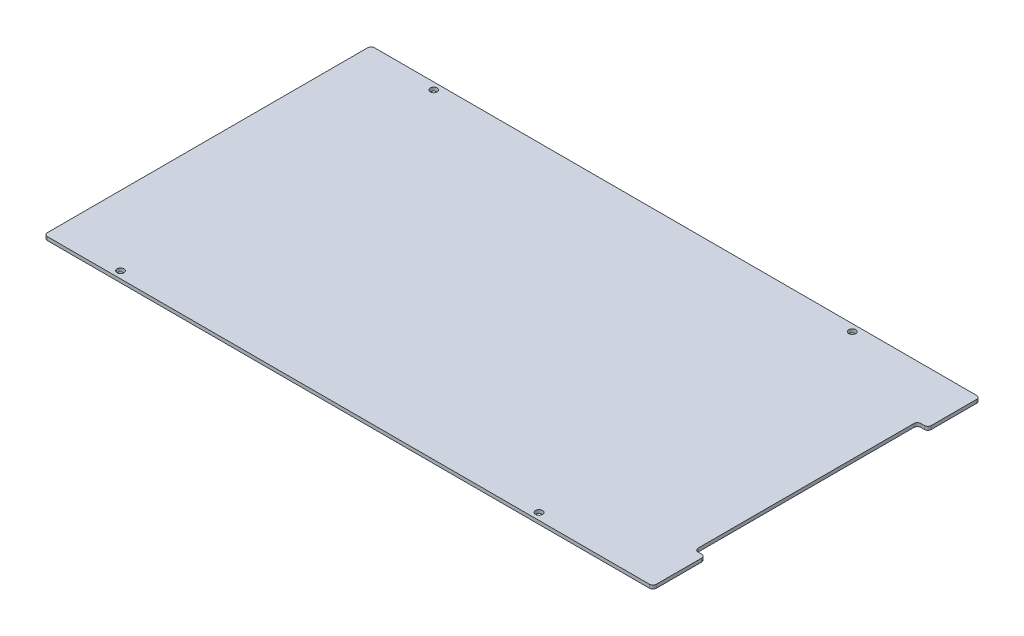
ISO-10303-21;
HEADER;
FILE_DESCRIPTION(('STEP AP214'),'2;1');
FILE_NAME('part.step','',(''),(''),'','','');
FILE_SCHEMA(('AUTOMOTIVE_DESIGN { 1 0 10303 214 1 1 1 1 }'));
ENDSEC;
DATA;
#1=APPLICATION_CONTEXT('core data for automotive mechanical design processes');
#2=APPLICATION_PROTOCOL_DEFINITION('international standard','automotive_design',2000,#1);
#3=PRODUCT_CONTEXT('',#1,'mechanical');
#4=PRODUCT('Part','Part','',(#3));
#5=PRODUCT_RELATED_PRODUCT_CATEGORY('part','',(#4));
#6=PRODUCT_DEFINITION_FORMATION('','',#4);
#7=PRODUCT_DEFINITION_CONTEXT('part definition',#1,'design');
#8=PRODUCT_DEFINITION('design','',#6,#7);
#9=PRODUCT_DEFINITION_SHAPE('','',#8);
#10=(LENGTH_UNIT() NAMED_UNIT(*) SI_UNIT(.MILLI.,.METRE.));
#11=(NAMED_UNIT(*) PLANE_ANGLE_UNIT() SI_UNIT($,.RADIAN.));
#12=(NAMED_UNIT(*) SI_UNIT($,.STERADIAN.) SOLID_ANGLE_UNIT());
#13=UNCERTAINTY_MEASURE_WITH_UNIT(LENGTH_MEASURE(1.E-05),#10,'distance_accuracy_value','');
#14=(GEOMETRIC_REPRESENTATION_CONTEXT(3) GLOBAL_UNCERTAINTY_ASSIGNED_CONTEXT((#13)) GLOBAL_UNIT_ASSIGNED_CONTEXT((#10,
#11,#12)) REPRESENTATION_CONTEXT('',''));
#15=CARTESIAN_POINT('',(0.,0.,0.));
#16=DIRECTION('',(0.,0.,1.));
#17=DIRECTION('',(1.,0.,0.));
#18=AXIS2_PLACEMENT_3D('',#15,#16,#17);
#19=CARTESIAN_POINT('',(277.8125,3.175,149.225));
#20=DIRECTION('',(-1.,0.,0.));
#21=DIRECTION('',(0.,0.,1.));
#22=AXIS2_PLACEMENT_3D('',#19,#20,#21);
#23=PLANE('',#22);
#24=DIRECTION('',(0.,0.,-1.));
#25=VECTOR('',#24,1.);
#26=CARTESIAN_POINT('',(277.8125,0.,149.225));
#27=LINE('',#26,#25);
#28=CARTESIAN_POINT('',(277.8125,0.,146.05));
#29=VERTEX_POINT('',#28);
#30=CARTESIAN_POINT('',(277.8125,0.,104.775));
#31=VERTEX_POINT('',#30);
#32=EDGE_CURVE('E198',#29,#31,#27,.T.);
#33=ORIENTED_EDGE('',*,*,#32,.T.);
#34=DIRECTION('',(0.,1.,0.));
#35=VECTOR('',#34,1.);
#36=CARTESIAN_POINT('',(277.8125,3.175,104.775));
#37=LINE('',#36,#35);
#38=CARTESIAN_POINT('',(277.8125,3.175,104.775));
#39=VERTEX_POINT('',#38);
#40=EDGE_CURVE('E251',#31,#39,#37,.T.);
#41=ORIENTED_EDGE('',*,*,#40,.T.);
#42=DIRECTION('',(0.,0.,-1.));
#43=VECTOR('',#42,1.);
#44=CARTESIAN_POINT('',(277.8125,3.175,149.225));
#45=LINE('',#44,#43);
#46=CARTESIAN_POINT('',(277.8125,3.175,146.05));
#47=VERTEX_POINT('',#46);
#48=EDGE_CURVE('E188',#47,#39,#45,.T.);
#49=ORIENTED_EDGE('',*,*,#48,.F.);
#50=DIRECTION('',(0.,-1.,0.));
#51=VECTOR('',#50,1.);
#52=CARTESIAN_POINT('',(277.8125,3.175,146.05));
#53=LINE('',#52,#51);
#54=EDGE_CURVE('E248',#47,#29,#53,.T.);
#55=ORIENTED_EDGE('',*,*,#54,.T.);
#56=EDGE_LOOP('',(#33,#41,#49,#55));
#57=FACE_BOUND('',#56,.T.);
#58=ADVANCED_FACE('F34',(#57),#23,.F.);
#59=CARTESIAN_POINT('',(277.8125,3.175,-104.775));
#60=VERTEX_POINT('',#59);
#61=CARTESIAN_POINT('',(277.8125,3.175,-146.05));
#62=VERTEX_POINT('',#61);
#63=EDGE_CURVE('E185',#60,#62,#45,.T.);
#64=ORIENTED_EDGE('',*,*,#63,.F.);
#65=DIRECTION('',(0.,1.,0.));
#66=VECTOR('',#65,1.);
#67=CARTESIAN_POINT('',(277.8125,3.175,-104.775));
#68=LINE('',#67,#66);
#69=CARTESIAN_POINT('',(277.8125,0.,-104.775));
#70=VERTEX_POINT('',#69);
#71=EDGE_CURVE('E236',#60,#70,#68,.F.);
#72=ORIENTED_EDGE('',*,*,#71,.T.);
#73=CARTESIAN_POINT('',(277.8125,0.,-146.05));
#74=VERTEX_POINT('',#73);
#75=EDGE_CURVE('E202',#70,#74,#27,.T.);
#76=ORIENTED_EDGE('',*,*,#75,.T.);
#77=DIRECTION('',(0.,-1.,0.));
#78=VECTOR('',#77,1.);
#79=CARTESIAN_POINT('',(277.8125,3.175,-146.05));
#80=LINE('',#79,#78);
#81=EDGE_CURVE('E234',#74,#62,#80,.F.);
#82=ORIENTED_EDGE('',*,*,#81,.T.);
#83=EDGE_LOOP('',(#64,#72,#76,#82));
#84=FACE_BOUND('',#83,.T.);
#85=ADVANCED_FACE('F301',(#84),#23,.F.);
#86=CARTESIAN_POINT('',(-277.8125,3.175,-149.225));
#87=DIRECTION('',(0.,0.,1.));
#88=DIRECTION('',(1.,0.,0.));
#89=AXIS2_PLACEMENT_3D('',#86,#87,#88);
#90=PLANE('',#89);
#91=DIRECTION('',(-1.,0.,0.));
#92=VECTOR('',#91,1.);
#93=CARTESIAN_POINT('',(-277.8125,3.175,-149.225));
#94=LINE('',#93,#92);
#95=CARTESIAN_POINT('',(274.6375,3.175,-149.225));
#96=VERTEX_POINT('',#95);
#97=CARTESIAN_POINT('',(-274.6375,3.175,-149.225));
#98=VERTEX_POINT('',#97);
#99=EDGE_CURVE('E190',#96,#98,#94,.T.);
#100=ORIENTED_EDGE('',*,*,#99,.F.);
#101=DIRECTION('',(0.,-1.,0.));
#102=VECTOR('',#101,1.);
#103=CARTESIAN_POINT('',(274.6375,3.175,-149.225));
#104=LINE('',#103,#102);
#105=CARTESIAN_POINT('',(274.6375,0.,-149.225));
#106=VERTEX_POINT('',#105);
#107=EDGE_CURVE('E258',#96,#106,#104,.T.);
#108=ORIENTED_EDGE('',*,*,#107,.T.);
#109=DIRECTION('',(-1.,0.,0.));
#110=VECTOR('',#109,1.);
#111=CARTESIAN_POINT('',(-277.8125,0.,-149.225));
#112=LINE('',#111,#110);
#113=CARTESIAN_POINT('',(-274.6375,0.,-149.225));
#114=VERTEX_POINT('',#113);
#115=EDGE_CURVE('E201',#106,#114,#112,.T.);
#116=ORIENTED_EDGE('',*,*,#115,.T.);
#117=DIRECTION('',(0.,-1.,0.));
#118=VECTOR('',#117,1.);
#119=CARTESIAN_POINT('',(-274.6375,3.175,-149.225));
#120=LINE('',#119,#118);
#121=EDGE_CURVE('E256',#114,#98,#120,.F.);
#122=ORIENTED_EDGE('',*,*,#121,.T.);
#123=EDGE_LOOP('',(#100,#108,#116,#122));
#124=FACE_BOUND('',#123,.T.);
#125=ADVANCED_FACE('F294',(#124),#90,.F.);
#126=CARTESIAN_POINT('',(-277.8125,3.175,149.225));
#127=DIRECTION('',(1.,0.,0.));
#128=DIRECTION('',(0.,0.,-1.));
#129=AXIS2_PLACEMENT_3D('',#126,#127,#128);
#130=PLANE('',#129);
#131=DIRECTION('',(0.,0.,1.));
#132=VECTOR('',#131,1.);
#133=CARTESIAN_POINT('',(-277.8125,3.175,149.225));
#134=LINE('',#133,#132);
#135=CARTESIAN_POINT('',(-277.8125,3.175,-146.05));
#136=VERTEX_POINT('',#135);
#137=CARTESIAN_POINT('',(-277.8125,3.175,146.05));
#138=VERTEX_POINT('',#137);
#139=EDGE_CURVE('E193',#136,#138,#134,.T.);
#140=ORIENTED_EDGE('',*,*,#139,.F.);
#141=DIRECTION('',(0.,-1.,0.));
#142=VECTOR('',#141,1.);
#143=CARTESIAN_POINT('',(-277.8125,3.175,-146.05));
#144=LINE('',#143,#142);
#145=CARTESIAN_POINT('',(-277.8125,0.,-146.05));
#146=VERTEX_POINT('',#145);
#147=EDGE_CURVE('E262',#136,#146,#144,.T.);
#148=ORIENTED_EDGE('',*,*,#147,.T.);
#149=DIRECTION('',(0.,0.,1.));
#150=VECTOR('',#149,1.);
#151=CARTESIAN_POINT('',(-277.8125,0.,149.225));
#152=LINE('',#151,#150);
#153=CARTESIAN_POINT('',(-277.8125,0.,146.05));
#154=VERTEX_POINT('',#153);
#155=EDGE_CURVE('E204',#146,#154,#152,.T.);
#156=ORIENTED_EDGE('',*,*,#155,.T.);
#157=DIRECTION('',(0.,-1.,0.));
#158=VECTOR('',#157,1.);
#159=CARTESIAN_POINT('',(-277.8125,3.175,146.05));
#160=LINE('',#159,#158);
#161=EDGE_CURVE('E260',#154,#138,#160,.F.);
#162=ORIENTED_EDGE('',*,*,#161,.T.);
#163=EDGE_LOOP('',(#140,#148,#156,#162));
#164=FACE_BOUND('',#163,.T.);
#165=ADVANCED_FACE('F286',(#164),#130,.F.);
#166=CARTESIAN_POINT('',(-277.8125,3.175,149.225));
#167=DIRECTION('',(0.,0.,-1.));
#168=DIRECTION('',(-1.,0.,0.));
#169=AXIS2_PLACEMENT_3D('',#166,#167,#168);
#170=PLANE('',#169);
#171=DIRECTION('',(1.,0.,0.));
#172=VECTOR('',#171,1.);
#173=CARTESIAN_POINT('',(-277.8125,0.,149.225));
#174=LINE('',#173,#172);
#175=CARTESIAN_POINT('',(-274.6375,0.,149.225));
#176=VERTEX_POINT('',#175);
#177=CARTESIAN_POINT('',(274.6375,0.,149.225));
#178=VERTEX_POINT('',#177);
#179=EDGE_CURVE('E189',#176,#178,#174,.T.);
#180=ORIENTED_EDGE('',*,*,#179,.T.);
#181=DIRECTION('',(0.,-1.,0.));
#182=VECTOR('',#181,1.);
#183=CARTESIAN_POINT('',(274.6375,3.175,149.225));
#184=LINE('',#183,#182);
#185=CARTESIAN_POINT('',(274.6375,3.175,149.225));
#186=VERTEX_POINT('',#185);
#187=EDGE_CURVE('E11',#178,#186,#184,.F.);
#188=ORIENTED_EDGE('',*,*,#187,.T.);
#189=DIRECTION('',(1.,0.,0.));
#190=VECTOR('',#189,1.);
#191=CARTESIAN_POINT('',(-277.8125,3.175,149.225));
#192=LINE('',#191,#190);
#193=CARTESIAN_POINT('',(-274.6375,3.175,149.225));
#194=VERTEX_POINT('',#193);
#195=EDGE_CURVE('E170',#194,#186,#192,.T.);
#196=ORIENTED_EDGE('',*,*,#195,.F.);
#197=DIRECTION('',(0.,-1.,0.));
#198=VECTOR('',#197,1.);
#199=CARTESIAN_POINT('',(-274.6375,3.175,149.225));
#200=LINE('',#199,#198);
#201=EDGE_CURVE('E42',#194,#176,#200,.T.);
#202=ORIENTED_EDGE('',*,*,#201,.T.);
#203=EDGE_LOOP('',(#180,#188,#196,#202));
#204=FACE_BOUND('',#203,.T.);
#205=ADVANCED_FACE('F269',(#204),#170,.F.);
#206=CARTESIAN_POINT('',(0.,3.175,0.));
#207=DIRECTION('',(0.,-1.,0.));
#208=DIRECTION('',(0.,0.,-1.));
#209=AXIS2_PLACEMENT_3D('',#206,#207,#208);
#210=PLANE('',#209);
#211=CARTESIAN_POINT('',(167.5765,3.175,-142.875));
#212=DIRECTION('',(0.,-1.,0.));
#213=DIRECTION('',(0.,0.,-1.));
#214=AXIS2_PLACEMENT_3D('',#211,#212,#213);
#215=CIRCLE('',#214,3.17500000000001);
#216=CARTESIAN_POINT('',(167.5765,3.175,-146.05));
#217=VERTEX_POINT('',#216);
#218=EDGE_CURVE('E329',#217,#217,#215,.T.);
#219=ORIENTED_EDGE('',*,*,#218,.T.);
#220=EDGE_LOOP('',(#219));
#221=FACE_BOUND('',#220,.T.);
#222=CARTESIAN_POINT('',(-214.3125,3.175,-142.875));
#223=DIRECTION('',(0.,-1.,0.));
#224=DIRECTION('',(0.,0.,-1.));
#225=AXIS2_PLACEMENT_3D('',#222,#223,#224);
#226=CIRCLE('',#225,3.17500000000001);
#227=CARTESIAN_POINT('',(-214.3125,3.175,-146.05));
#228=VERTEX_POINT('',#227);
#229=EDGE_CURVE('E323',#228,#228,#226,.T.);
#230=ORIENTED_EDGE('',*,*,#229,.T.);
#231=EDGE_LOOP('',(#230));
#232=FACE_BOUND('',#231,.T.);
#233=CARTESIAN_POINT('',(167.5765,3.175,142.875));
#234=DIRECTION('',(0.,-1.,0.));
#235=DIRECTION('',(0.,0.,-1.));
#236=AXIS2_PLACEMENT_3D('',#233,#234,#235);
#237=CIRCLE('',#236,3.17500000000001);
#238=CARTESIAN_POINT('',(167.5765,3.175,139.7));
#239=VERTEX_POINT('',#238);
#240=EDGE_CURVE('E315',#239,#239,#237,.T.);
#241=ORIENTED_EDGE('',*,*,#240,.T.);
#242=EDGE_LOOP('',(#241));
#243=FACE_BOUND('',#242,.T.);
#244=CARTESIAN_POINT('',(-214.3125,3.175,142.875));
#245=DIRECTION('',(0.,-1.,0.));
#246=DIRECTION('',(0.,0.,-1.));
#247=AXIS2_PLACEMENT_3D('',#244,#245,#246);
#248=CIRCLE('',#247,3.17500000000001);
#249=CARTESIAN_POINT('',(-214.3125,3.175,139.7));
#250=VERTEX_POINT('',#249);
#251=EDGE_CURVE('E307',#250,#250,#248,.T.);
#252=ORIENTED_EDGE('',*,*,#251,.T.);
#253=EDGE_LOOP('',(#252));
#254=FACE_BOUND('',#253,.T.);
#255=DIRECTION('',(-1.,0.,0.));
#256=VECTOR('',#255,1.);
#257=CARTESIAN_POINT('',(277.8125,3.175,-101.6));
#258=LINE('',#257,#256);
#259=CARTESIAN_POINT('',(274.6375,3.175,-101.6));
#260=VERTEX_POINT('',#259);
#261=CARTESIAN_POINT('',(271.4625,3.175,-101.6));
#262=VERTEX_POINT('',#261);
#263=EDGE_CURVE('E181',#260,#262,#258,.T.);
#264=ORIENTED_EDGE('',*,*,#263,.F.);
#265=CARTESIAN_POINT('',(274.6375,3.175,-104.775));
#266=DIRECTION('',(0.,-1.,0.));
#267=DIRECTION('',(0.,0.,-1.));
#268=AXIS2_PLACEMENT_3D('',#265,#266,#267);
#269=CIRCLE('',#268,3.175);
#270=EDGE_CURVE('E232',#260,#60,#269,.F.);
#271=ORIENTED_EDGE('',*,*,#270,.T.);
#272=ORIENTED_EDGE('',*,*,#63,.T.);
#273=CARTESIAN_POINT('',(274.6375,3.175,-146.05));
#274=DIRECTION('',(0.,-1.,0.));
#275=DIRECTION('',(0.,0.,-1.));
#276=AXIS2_PLACEMENT_3D('',#273,#274,#275);
#277=CIRCLE('',#276,3.175);
#278=EDGE_CURVE('E229',#62,#96,#277,.F.);
#279=ORIENTED_EDGE('',*,*,#278,.T.);
#280=ORIENTED_EDGE('',*,*,#99,.T.);
#281=CARTESIAN_POINT('',(-274.6375,3.175,-146.05));
#282=DIRECTION('',(0.,-1.,0.));
#283=DIRECTION('',(0.,0.,-1.));
#284=AXIS2_PLACEMENT_3D('',#281,#282,#283);
#285=CIRCLE('',#284,3.175);
#286=EDGE_CURVE('E227',#98,#136,#285,.F.);
#287=ORIENTED_EDGE('',*,*,#286,.T.);
#288=ORIENTED_EDGE('',*,*,#139,.T.);
#289=CARTESIAN_POINT('',(-274.6375,3.175,146.05));
#290=DIRECTION('',(0.,-1.,0.));
#291=DIRECTION('',(0.,0.,-1.));
#292=AXIS2_PLACEMENT_3D('',#289,#290,#291);
#293=CIRCLE('',#292,3.175);
#294=EDGE_CURVE('E223',#138,#194,#293,.F.);
#295=ORIENTED_EDGE('',*,*,#294,.T.);
#296=ORIENTED_EDGE('',*,*,#195,.T.);
#297=CARTESIAN_POINT('',(274.6375,3.175,146.05));
#298=DIRECTION('',(0.,-1.,0.));
#299=DIRECTION('',(0.,0.,-1.));
#300=AXIS2_PLACEMENT_3D('',#297,#298,#299);
#301=CIRCLE('',#300,3.175);
#302=EDGE_CURVE('E225',#186,#47,#301,.F.);
#303=ORIENTED_EDGE('',*,*,#302,.T.);
#304=ORIENTED_EDGE('',*,*,#48,.T.);
#305=CARTESIAN_POINT('',(274.6375,3.175,104.775));
#306=DIRECTION('',(0.,-1.,0.));
#307=DIRECTION('',(0.,0.,-1.));
#308=AXIS2_PLACEMENT_3D('',#305,#306,#307);
#309=CIRCLE('',#308,3.175);
#310=CARTESIAN_POINT('',(274.6375,3.175,101.6));
#311=VERTEX_POINT('',#310);
#312=EDGE_CURVE('E175',#39,#311,#309,.F.);
#313=ORIENTED_EDGE('',*,*,#312,.T.);
#314=DIRECTION('',(1.,0.,0.));
#315=VECTOR('',#314,1.);
#316=CARTESIAN_POINT('',(277.8125,3.175,101.6));
#317=LINE('',#316,#315);
#318=CARTESIAN_POINT('',(271.4625,3.175,101.6));
#319=VERTEX_POINT('',#318);
#320=EDGE_CURVE('E165',#319,#311,#317,.T.);
#321=ORIENTED_EDGE('',*,*,#320,.F.);
#322=CARTESIAN_POINT('',(271.4625,3.175,98.425));
#323=DIRECTION('',(0.,-1.,0.));
#324=DIRECTION('',(0.,0.,-1.));
#325=AXIS2_PLACEMENT_3D('',#322,#323,#324);
#326=CIRCLE('',#325,3.175);
#327=CARTESIAN_POINT('',(268.2875,3.175,98.425));
#328=VERTEX_POINT('',#327);
#329=EDGE_CURVE('E148',#319,#328,#326,.T.);
#330=ORIENTED_EDGE('',*,*,#329,.T.);
#331=DIRECTION('',(0.,0.,1.));
#332=VECTOR('',#331,1.);
#333=CARTESIAN_POINT('',(268.2875,3.175,-101.6));
#334=LINE('',#333,#332);
#335=CARTESIAN_POINT('',(268.2875,3.175,-98.425));
#336=VERTEX_POINT('',#335);
#337=EDGE_CURVE('E177',#336,#328,#334,.T.);
#338=ORIENTED_EDGE('',*,*,#337,.F.);
#339=CARTESIAN_POINT('',(271.4625,3.175,-98.425));
#340=DIRECTION('',(0.,-1.,0.));
#341=DIRECTION('',(0.,0.,-1.));
#342=AXIS2_PLACEMENT_3D('',#339,#340,#341);
#343=CIRCLE('',#342,3.175);
#344=EDGE_CURVE('E215',#336,#262,#343,.T.);
#345=ORIENTED_EDGE('',*,*,#344,.T.);
#346=EDGE_LOOP('',(#264,#271,#272,#279,#280,#287,#288,#295,#296,#303,#304,#313,#321,#330,#338,#345));
#347=FACE_BOUND('',#346,.T.);
#348=ADVANCED_FACE('F173',(#221,#232,#243,#254,#347),#210,.F.);
#349=CARTESIAN_POINT('',(0.,0.,0.));
#350=DIRECTION('',(0.,-1.,0.));
#351=DIRECTION('',(0.,0.,-1.));
#352=AXIS2_PLACEMENT_3D('',#349,#350,#351);
#353=PLANE('',#352);
#354=CARTESIAN_POINT('',(167.5765,0.,-142.875));
#355=DIRECTION('',(0.,-1.,0.));
#356=DIRECTION('',(0.,0.,-1.));
#357=AXIS2_PLACEMENT_3D('',#354,#355,#356);
#358=CIRCLE('',#357,3.17499999999998);
#359=CARTESIAN_POINT('',(167.5765,0.,-146.05));
#360=VERTEX_POINT('',#359);
#361=EDGE_CURVE('E332',#360,#360,#358,.T.);
#362=ORIENTED_EDGE('',*,*,#361,.F.);
#363=EDGE_LOOP('',(#362));
#364=FACE_BOUND('',#363,.T.);
#365=CARTESIAN_POINT('',(-214.3125,0.,-142.875));
#366=DIRECTION('',(0.,-1.,0.));
#367=DIRECTION('',(0.,0.,-1.));
#368=AXIS2_PLACEMENT_3D('',#365,#366,#367);
#369=CIRCLE('',#368,3.17499999999998);
#370=CARTESIAN_POINT('',(-214.3125,0.,-146.05));
#371=VERTEX_POINT('',#370);
#372=EDGE_CURVE('E326',#371,#371,#369,.T.);
#373=ORIENTED_EDGE('',*,*,#372,.F.);
#374=EDGE_LOOP('',(#373));
#375=FACE_BOUND('',#374,.T.);
#376=CARTESIAN_POINT('',(167.5765,0.,142.875));
#377=DIRECTION('',(0.,-1.,0.));
#378=DIRECTION('',(0.,0.,-1.));
#379=AXIS2_PLACEMENT_3D('',#376,#377,#378);
#380=CIRCLE('',#379,3.17499999999998);
#381=CARTESIAN_POINT('',(167.5765,0.,139.7));
#382=VERTEX_POINT('',#381);
#383=EDGE_CURVE('E320',#382,#382,#380,.T.);
#384=ORIENTED_EDGE('',*,*,#383,.F.);
#385=EDGE_LOOP('',(#384));
#386=FACE_BOUND('',#385,.T.);
#387=CARTESIAN_POINT('',(-214.3125,0.,142.875));
#388=DIRECTION('',(0.,-1.,0.));
#389=DIRECTION('',(0.,0.,-1.));
#390=AXIS2_PLACEMENT_3D('',#387,#388,#389);
#391=CIRCLE('',#390,3.17499999999998);
#392=CARTESIAN_POINT('',(-214.3125,0.,139.7));
#393=VERTEX_POINT('',#392);
#394=EDGE_CURVE('E310',#393,#393,#391,.T.);
#395=ORIENTED_EDGE('',*,*,#394,.F.);
#396=EDGE_LOOP('',(#395));
#397=FACE_BOUND('',#396,.T.);
#398=ORIENTED_EDGE('',*,*,#75,.F.);
#399=CARTESIAN_POINT('',(274.6375,0.,-104.775));
#400=DIRECTION('',(0.,-1.,0.));
#401=DIRECTION('',(0.,0.,-1.));
#402=AXIS2_PLACEMENT_3D('',#399,#400,#401);
#403=CIRCLE('',#402,3.175);
#404=CARTESIAN_POINT('',(274.6375,0.,-101.6));
#405=VERTEX_POINT('',#404);
#406=EDGE_CURVE('E246',#70,#405,#403,.T.);
#407=ORIENTED_EDGE('',*,*,#406,.T.);
#408=DIRECTION('',(-1.,0.,0.));
#409=VECTOR('',#408,1.);
#410=CARTESIAN_POINT('',(277.8125,0.,-101.6));
#411=LINE('',#410,#409);
#412=CARTESIAN_POINT('',(271.4625,0.,-101.6));
#413=VERTEX_POINT('',#412);
#414=EDGE_CURVE('E176',#405,#413,#411,.T.);
#415=ORIENTED_EDGE('',*,*,#414,.T.);
#416=CARTESIAN_POINT('',(271.4625,0.,-98.425));
#417=DIRECTION('',(0.,-1.,0.));
#418=DIRECTION('',(0.,0.,-1.));
#419=AXIS2_PLACEMENT_3D('',#416,#417,#418);
#420=CIRCLE('',#419,3.175);
#421=CARTESIAN_POINT('',(268.2875,0.,-98.425));
#422=VERTEX_POINT('',#421);
#423=EDGE_CURVE('E218',#413,#422,#420,.F.);
#424=ORIENTED_EDGE('',*,*,#423,.T.);
#425=DIRECTION('',(0.,0.,1.));
#426=VECTOR('',#425,1.);
#427=CARTESIAN_POINT('',(268.2875,0.,-101.6));
#428=LINE('',#427,#426);
#429=CARTESIAN_POINT('',(268.2875,0.,98.425));
#430=VERTEX_POINT('',#429);
#431=EDGE_CURVE('E179',#422,#430,#428,.T.);
#432=ORIENTED_EDGE('',*,*,#431,.T.);
#433=CARTESIAN_POINT('',(271.4625,0.,98.425));
#434=DIRECTION('',(0.,-1.,0.));
#435=DIRECTION('',(0.,0.,-1.));
#436=AXIS2_PLACEMENT_3D('',#433,#434,#435);
#437=CIRCLE('',#436,3.175);
#438=CARTESIAN_POINT('',(271.4625,0.,101.6));
#439=VERTEX_POINT('',#438);
#440=EDGE_CURVE('E158',#430,#439,#437,.F.);
#441=ORIENTED_EDGE('',*,*,#440,.T.);
#442=DIRECTION('',(1.,0.,0.));
#443=VECTOR('',#442,1.);
#444=CARTESIAN_POINT('',(277.8125,0.,101.6));
#445=LINE('',#444,#443);
#446=CARTESIAN_POINT('',(274.6375,0.,101.6));
#447=VERTEX_POINT('',#446);
#448=EDGE_CURVE('E168',#439,#447,#445,.T.);
#449=ORIENTED_EDGE('',*,*,#448,.T.);
#450=CARTESIAN_POINT('',(274.6375,0.,104.775));
#451=DIRECTION('',(0.,-1.,0.));
#452=DIRECTION('',(0.,0.,-1.));
#453=AXIS2_PLACEMENT_3D('',#450,#451,#452);
#454=CIRCLE('',#453,3.175);
#455=EDGE_CURVE('E244',#447,#31,#454,.T.);
#456=ORIENTED_EDGE('',*,*,#455,.T.);
#457=ORIENTED_EDGE('',*,*,#32,.F.);
#458=CARTESIAN_POINT('',(274.6375,0.,146.05));
#459=DIRECTION('',(0.,-1.,0.));
#460=DIRECTION('',(0.,0.,-1.));
#461=AXIS2_PLACEMENT_3D('',#458,#459,#460);
#462=CIRCLE('',#461,3.175);
#463=EDGE_CURVE('E240',#29,#178,#462,.T.);
#464=ORIENTED_EDGE('',*,*,#463,.T.);
#465=ORIENTED_EDGE('',*,*,#179,.F.);
#466=CARTESIAN_POINT('',(-274.6375,0.,146.05));
#467=DIRECTION('',(0.,-1.,0.));
#468=DIRECTION('',(0.,0.,-1.));
#469=AXIS2_PLACEMENT_3D('',#466,#467,#468);
#470=CIRCLE('',#469,3.175);
#471=EDGE_CURVE('E238',#176,#154,#470,.T.);
#472=ORIENTED_EDGE('',*,*,#471,.T.);
#473=ORIENTED_EDGE('',*,*,#155,.F.);
#474=CARTESIAN_POINT('',(-274.6375,0.,-146.05));
#475=DIRECTION('',(0.,-1.,0.));
#476=DIRECTION('',(0.,0.,-1.));
#477=AXIS2_PLACEMENT_3D('',#474,#475,#476);
#478=CIRCLE('',#477,3.175);
#479=EDGE_CURVE('E49',#146,#114,#478,.T.);
#480=ORIENTED_EDGE('',*,*,#479,.T.);
#481=ORIENTED_EDGE('',*,*,#115,.F.);
#482=CARTESIAN_POINT('',(274.6375,0.,-146.05));
#483=DIRECTION('',(0.,-1.,0.));
#484=DIRECTION('',(0.,0.,-1.));
#485=AXIS2_PLACEMENT_3D('',#482,#483,#484);
#486=CIRCLE('',#485,3.175);
#487=EDGE_CURVE('E57',#106,#74,#486,.T.);
#488=ORIENTED_EDGE('',*,*,#487,.T.);
#489=EDGE_LOOP('',(#398,#407,#415,#424,#432,#441,#449,#456,#457,#464,#465,#472,#473,#480,#481,#488));
#490=FACE_BOUND('',#489,.T.);
#491=ADVANCED_FACE('F274',(#364,#375,#386,#397,#490),#353,.T.);
#492=CARTESIAN_POINT('',(277.8125,0.,101.6));
#493=DIRECTION('',(0.,0.,1.));
#494=DIRECTION('',(1.,0.,0.));
#495=AXIS2_PLACEMENT_3D('',#492,#493,#494);
#496=PLANE('',#495);
#497=ORIENTED_EDGE('',*,*,#320,.T.);
#498=DIRECTION('',(0.,1.,0.));
#499=VECTOR('',#498,1.);
#500=CARTESIAN_POINT('',(274.6375,0.,101.6));
#501=LINE('',#500,#499);
#502=EDGE_CURVE('E254',#311,#447,#501,.F.);
#503=ORIENTED_EDGE('',*,*,#502,.T.);
#504=ORIENTED_EDGE('',*,*,#448,.F.);
#505=DIRECTION('',(0.,1.,0.));
#506=VECTOR('',#505,1.);
#507=CARTESIAN_POINT('',(271.4625,3.175,101.6));
#508=LINE('',#507,#506);
#509=EDGE_CURVE('E152',#439,#319,#508,.T.);
#510=ORIENTED_EDGE('',*,*,#509,.T.);
#511=EDGE_LOOP('',(#497,#503,#504,#510));
#512=FACE_BOUND('',#511,.T.);
#513=ADVANCED_FACE('F164',(#512),#496,.F.);
#514=CARTESIAN_POINT('',(268.2875,0.,-101.6));
#515=DIRECTION('',(-1.,0.,0.));
#516=DIRECTION('',(0.,0.,1.));
#517=AXIS2_PLACEMENT_3D('',#514,#515,#516);
#518=PLANE('',#517);
#519=ORIENTED_EDGE('',*,*,#337,.T.);
#520=DIRECTION('',(0.,1.,0.));
#521=VECTOR('',#520,1.);
#522=CARTESIAN_POINT('',(268.2875,0.,98.425));
#523=LINE('',#522,#521);
#524=EDGE_CURVE('E153',#328,#430,#523,.F.);
#525=ORIENTED_EDGE('',*,*,#524,.T.);
#526=ORIENTED_EDGE('',*,*,#431,.F.);
#527=DIRECTION('',(0.,1.,0.));
#528=VECTOR('',#527,1.);
#529=CARTESIAN_POINT('',(268.2875,3.175,-98.425));
#530=LINE('',#529,#528);
#531=EDGE_CURVE('E169',#422,#336,#530,.T.);
#532=ORIENTED_EDGE('',*,*,#531,.T.);
#533=EDGE_LOOP('',(#519,#525,#526,#532));
#534=FACE_BOUND('',#533,.T.);
#535=ADVANCED_FACE('F430',(#534),#518,.F.);
#536=CARTESIAN_POINT('',(277.8125,0.,-101.6));
#537=DIRECTION('',(0.,0.,-1.));
#538=DIRECTION('',(-1.,0.,0.));
#539=AXIS2_PLACEMENT_3D('',#536,#537,#538);
#540=PLANE('',#539);
#541=ORIENTED_EDGE('',*,*,#414,.F.);
#542=DIRECTION('',(0.,1.,0.));
#543=VECTOR('',#542,1.);
#544=CARTESIAN_POINT('',(274.6375,0.,-101.6));
#545=LINE('',#544,#543);
#546=EDGE_CURVE('E220',#405,#260,#545,.T.);
#547=ORIENTED_EDGE('',*,*,#546,.T.);
#548=ORIENTED_EDGE('',*,*,#263,.T.);
#549=DIRECTION('',(0.,1.,0.));
#550=VECTOR('',#549,1.);
#551=CARTESIAN_POINT('',(271.4625,0.,-101.6));
#552=LINE('',#551,#550);
#553=EDGE_CURVE('E159',#262,#413,#552,.F.);
#554=ORIENTED_EDGE('',*,*,#553,.T.);
#555=EDGE_LOOP('',(#541,#547,#548,#554));
#556=FACE_BOUND('',#555,.T.);
#557=ADVANCED_FACE('F372',(#556),#540,.F.);
#558=CARTESIAN_POINT('',(271.4625,0.,98.425));
#559=DIRECTION('',(0.,-1.,0.));
#560=DIRECTION('',(0.,0.,-1.));
#561=AXIS2_PLACEMENT_3D('',#558,#559,#560);
#562=CYLINDRICAL_SURFACE('',#561,3.175);
#563=ORIENTED_EDGE('',*,*,#440,.F.);
#564=ORIENTED_EDGE('',*,*,#524,.F.);
#565=ORIENTED_EDGE('',*,*,#329,.F.);
#566=ORIENTED_EDGE('',*,*,#509,.F.);
#567=EDGE_LOOP('',(#563,#564,#565,#566));
#568=FACE_BOUND('',#567,.T.);
#569=ADVANCED_FACE('F151',(#568),#562,.F.);
#570=CARTESIAN_POINT('',(271.4625,0.,-98.425));
#571=DIRECTION('',(0.,-1.,0.));
#572=DIRECTION('',(0.,0.,-1.));
#573=AXIS2_PLACEMENT_3D('',#570,#571,#572);
#574=CYLINDRICAL_SURFACE('',#573,3.175);
#575=ORIENTED_EDGE('',*,*,#423,.F.);
#576=ORIENTED_EDGE('',*,*,#553,.F.);
#577=ORIENTED_EDGE('',*,*,#344,.F.);
#578=ORIENTED_EDGE('',*,*,#531,.F.);
#579=EDGE_LOOP('',(#575,#576,#577,#578));
#580=FACE_BOUND('',#579,.T.);
#581=ADVANCED_FACE('F350',(#580),#574,.F.);
#582=CARTESIAN_POINT('',(-214.3125,0.,142.875));
#583=DIRECTION('',(0.,-1.,0.));
#584=DIRECTION('',(0.,0.,-1.));
#585=AXIS2_PLACEMENT_3D('',#582,#583,#584);
#586=CYLINDRICAL_SURFACE('',#585,3.175);
#587=ORIENTED_EDGE('',*,*,#251,.F.);
#588=EDGE_LOOP('',(#587));
#589=FACE_BOUND('',#588,.T.);
#590=ORIENTED_EDGE('',*,*,#394,.T.);
#591=EDGE_LOOP('',(#590));
#592=FACE_BOUND('',#591,.T.);
#593=ADVANCED_FACE('F347',(#589,#592),#586,.F.);
#594=CARTESIAN_POINT('',(167.5765,0.,142.875));
#595=DIRECTION('',(0.,-1.,0.));
#596=DIRECTION('',(0.,0.,-1.));
#597=AXIS2_PLACEMENT_3D('',#594,#595,#596);
#598=CYLINDRICAL_SURFACE('',#597,3.175);
#599=ORIENTED_EDGE('',*,*,#240,.F.);
#600=EDGE_LOOP('',(#599));
#601=FACE_BOUND('',#600,.T.);
#602=ORIENTED_EDGE('',*,*,#383,.T.);
#603=EDGE_LOOP('',(#602));
#604=FACE_BOUND('',#603,.T.);
#605=ADVANCED_FACE('F349',(#601,#604),#598,.F.);
#606=CARTESIAN_POINT('',(-214.3125,0.,-142.875));
#607=DIRECTION('',(0.,-1.,0.));
#608=DIRECTION('',(0.,0.,-1.));
#609=AXIS2_PLACEMENT_3D('',#606,#607,#608);
#610=CYLINDRICAL_SURFACE('',#609,3.175);
#611=ORIENTED_EDGE('',*,*,#229,.F.);
#612=EDGE_LOOP('',(#611));
#613=FACE_BOUND('',#612,.T.);
#614=ORIENTED_EDGE('',*,*,#372,.T.);
#615=EDGE_LOOP('',(#614));
#616=FACE_BOUND('',#615,.T.);
#617=ADVANCED_FACE('F357',(#613,#616),#610,.F.);
#618=CARTESIAN_POINT('',(167.5765,0.,-142.875));
#619=DIRECTION('',(0.,-1.,0.));
#620=DIRECTION('',(0.,0.,-1.));
#621=AXIS2_PLACEMENT_3D('',#618,#619,#620);
#622=CYLINDRICAL_SURFACE('',#621,3.175);
#623=ORIENTED_EDGE('',*,*,#218,.F.);
#624=EDGE_LOOP('',(#623));
#625=FACE_BOUND('',#624,.T.);
#626=ORIENTED_EDGE('',*,*,#361,.T.);
#627=EDGE_LOOP('',(#626));
#628=FACE_BOUND('',#627,.T.);
#629=ADVANCED_FACE('F336',(#625,#628),#622,.F.);
#630=CARTESIAN_POINT('',(274.6375,0.,-104.775));
#631=DIRECTION('',(0.,1.,0.));
#632=DIRECTION('',(0.,0.,1.));
#633=AXIS2_PLACEMENT_3D('',#630,#631,#632);
#634=CYLINDRICAL_SURFACE('',#633,3.175);
#635=ORIENTED_EDGE('',*,*,#406,.F.);
#636=ORIENTED_EDGE('',*,*,#71,.F.);
#637=ORIENTED_EDGE('',*,*,#270,.F.);
#638=ORIENTED_EDGE('',*,*,#546,.F.);
#639=EDGE_LOOP('',(#635,#636,#637,#638));
#640=FACE_BOUND('',#639,.T.);
#641=ADVANCED_FACE('F374',(#640),#634,.T.);
#642=CARTESIAN_POINT('',(274.6375,3.175,104.775));
#643=DIRECTION('',(0.,1.,0.));
#644=DIRECTION('',(0.,0.,1.));
#645=AXIS2_PLACEMENT_3D('',#642,#643,#644);
#646=CYLINDRICAL_SURFACE('',#645,3.175);
#647=ORIENTED_EDGE('',*,*,#455,.F.);
#648=ORIENTED_EDGE('',*,*,#502,.F.);
#649=ORIENTED_EDGE('',*,*,#312,.F.);
#650=ORIENTED_EDGE('',*,*,#40,.F.);
#651=EDGE_LOOP('',(#647,#648,#649,#650));
#652=FACE_BOUND('',#651,.T.);
#653=ADVANCED_FACE('F377',(#652),#646,.T.);
#654=CARTESIAN_POINT('',(274.6375,3.175,-146.05));
#655=DIRECTION('',(0.,-1.,0.));
#656=DIRECTION('',(0.,0.,-1.));
#657=AXIS2_PLACEMENT_3D('',#654,#655,#656);
#658=CYLINDRICAL_SURFACE('',#657,3.175);
#659=ORIENTED_EDGE('',*,*,#278,.F.);
#660=ORIENTED_EDGE('',*,*,#81,.F.);
#661=ORIENTED_EDGE('',*,*,#487,.F.);
#662=ORIENTED_EDGE('',*,*,#107,.F.);
#663=EDGE_LOOP('',(#659,#660,#661,#662));
#664=FACE_BOUND('',#663,.T.);
#665=ADVANCED_FACE('F297',(#664),#658,.T.);
#666=CARTESIAN_POINT('',(-274.6375,3.175,-146.05));
#667=DIRECTION('',(0.,-1.,0.));
#668=DIRECTION('',(0.,0.,-1.));
#669=AXIS2_PLACEMENT_3D('',#666,#667,#668);
#670=CYLINDRICAL_SURFACE('',#669,3.175);
#671=ORIENTED_EDGE('',*,*,#286,.F.);
#672=ORIENTED_EDGE('',*,*,#121,.F.);
#673=ORIENTED_EDGE('',*,*,#479,.F.);
#674=ORIENTED_EDGE('',*,*,#147,.F.);
#675=EDGE_LOOP('',(#671,#672,#673,#674));
#676=FACE_BOUND('',#675,.T.);
#677=ADVANCED_FACE('F290',(#676),#670,.T.);
#678=CARTESIAN_POINT('',(274.6375,3.175,146.05));
#679=DIRECTION('',(0.,-1.,0.));
#680=DIRECTION('',(0.,0.,-1.));
#681=AXIS2_PLACEMENT_3D('',#678,#679,#680);
#682=CYLINDRICAL_SURFACE('',#681,3.175);
#683=ORIENTED_EDGE('',*,*,#302,.F.);
#684=ORIENTED_EDGE('',*,*,#187,.F.);
#685=ORIENTED_EDGE('',*,*,#463,.F.);
#686=ORIENTED_EDGE('',*,*,#54,.F.);
#687=EDGE_LOOP('',(#683,#684,#685,#686));
#688=FACE_BOUND('',#687,.T.);
#689=ADVANCED_FACE('F279',(#688),#682,.T.);
#690=CARTESIAN_POINT('',(-274.6375,3.175,146.05));
#691=DIRECTION('',(0.,-1.,0.));
#692=DIRECTION('',(0.,0.,-1.));
#693=AXIS2_PLACEMENT_3D('',#690,#691,#692);
#694=CYLINDRICAL_SURFACE('',#693,3.175);
#695=ORIENTED_EDGE('',*,*,#294,.F.);
#696=ORIENTED_EDGE('',*,*,#161,.F.);
#697=ORIENTED_EDGE('',*,*,#471,.F.);
#698=ORIENTED_EDGE('',*,*,#201,.F.);
#699=EDGE_LOOP('',(#695,#696,#697,#698));
#700=FACE_BOUND('',#699,.T.);
#701=ADVANCED_FACE('F36',(#700),#694,.T.);
#702=CLOSED_SHELL('',(#58,#85,#125,#165,#205,#348,#491,#513,#535,#557,#569,#581,#593,#605,#617,
#629,#641,#653,#665,#677,#689,#701));
#703=MANIFOLD_SOLID_BREP('B2',#702);
#704=ADVANCED_BREP_SHAPE_REPRESENTATION('',(#18,#703),#14);
#705=SHAPE_DEFINITION_REPRESENTATION(#9,#704);
ENDSEC;
END-ISO-10303-21;
